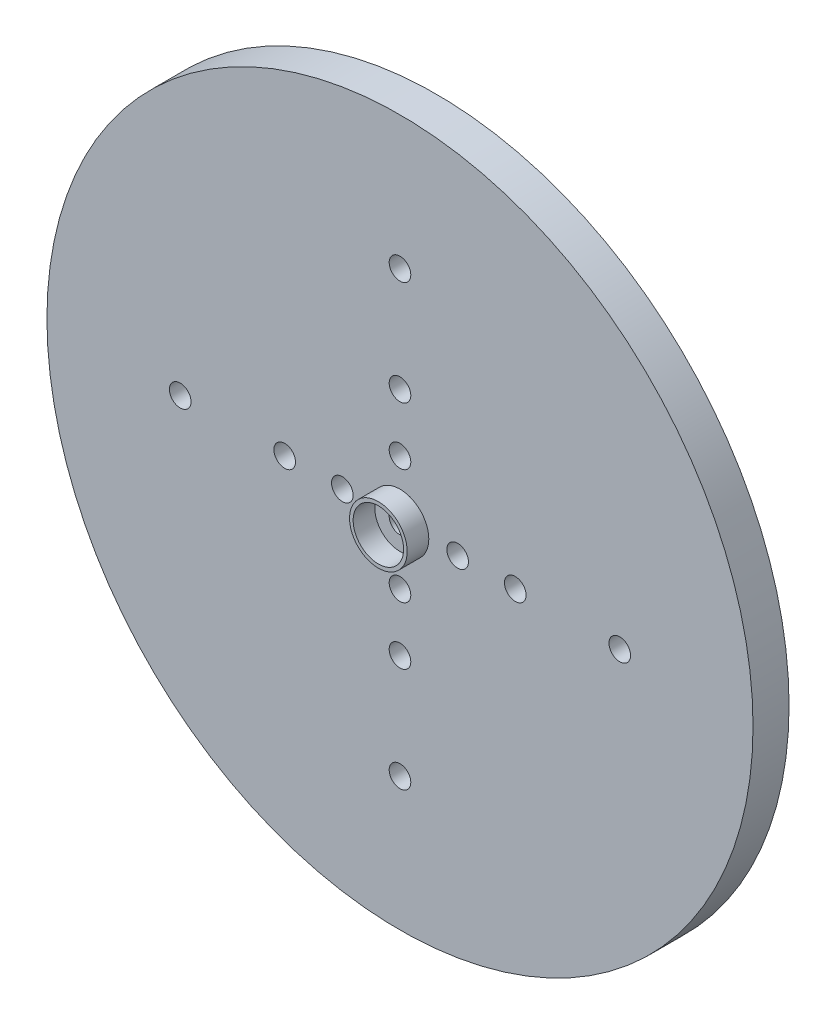
ISO-10303-21;
HEADER;
FILE_DESCRIPTION(('STEP AP214'),'2;1');
FILE_NAME('part.step','',(''),(''),'','','');
FILE_SCHEMA(('AUTOMOTIVE_DESIGN { 1 0 10303 214 1 1 1 1 }'));
ENDSEC;
DATA;
#1=APPLICATION_CONTEXT('core data for automotive mechanical design processes');
#2=APPLICATION_PROTOCOL_DEFINITION('international standard','automotive_design',2000,#1);
#3=PRODUCT_CONTEXT('',#1,'mechanical');
#4=PRODUCT('Part','Part','',(#3));
#5=PRODUCT_RELATED_PRODUCT_CATEGORY('part','',(#4));
#6=PRODUCT_DEFINITION_FORMATION('','',#4);
#7=PRODUCT_DEFINITION_CONTEXT('part definition',#1,'design');
#8=PRODUCT_DEFINITION('design','',#6,#7);
#9=PRODUCT_DEFINITION_SHAPE('','',#8);
#10=(LENGTH_UNIT() NAMED_UNIT(*) SI_UNIT(.MILLI.,.METRE.));
#11=(NAMED_UNIT(*) PLANE_ANGLE_UNIT() SI_UNIT($,.RADIAN.));
#12=(NAMED_UNIT(*) SI_UNIT($,.STERADIAN.) SOLID_ANGLE_UNIT());
#13=UNCERTAINTY_MEASURE_WITH_UNIT(LENGTH_MEASURE(1.E-05),#10,'distance_accuracy_value','');
#14=(GEOMETRIC_REPRESENTATION_CONTEXT(3) GLOBAL_UNCERTAINTY_ASSIGNED_CONTEXT((#13)) GLOBAL_UNIT_ASSIGNED_CONTEXT((#10,
#11,#12)) REPRESENTATION_CONTEXT('',''));
#15=CARTESIAN_POINT('',(0.,0.,0.));
#16=DIRECTION('',(0.,0.,1.));
#17=DIRECTION('',(1.,0.,0.));
#18=AXIS2_PLACEMENT_3D('',#15,#16,#17);
#19=CARTESIAN_POINT('',(-26.6505829621075,0.,5.));
#20=DIRECTION('',(0.,0.,-1.));
#21=DIRECTION('',(-1.,0.,0.));
#22=AXIS2_PLACEMENT_3D('',#19,#20,#21);
#23=CYLINDRICAL_SURFACE('',#22,49.);
#24=CARTESIAN_POINT('',(-26.6505829621075,0.,5.));
#25=DIRECTION('',(0.,0.,1.));
#26=DIRECTION('',(1.,0.,0.));
#27=AXIS2_PLACEMENT_3D('',#24,#25,#26);
#28=CIRCLE('',#27,49.);
#29=CARTESIAN_POINT('',(22.3494170378925,0.,5.));
#30=VERTEX_POINT('',#29);
#31=EDGE_CURVE('E40',#30,#30,#28,.T.);
#32=ORIENTED_EDGE('',*,*,#31,.F.);
#33=EDGE_LOOP('',(#32));
#34=FACE_BOUND('',#33,.T.);
#35=CARTESIAN_POINT('',(-26.6505829621075,0.,0.));
#36=DIRECTION('',(0.,0.,1.));
#37=DIRECTION('',(1.,0.,0.));
#38=AXIS2_PLACEMENT_3D('',#35,#36,#37);
#39=CIRCLE('',#38,49.);
#40=CARTESIAN_POINT('',(22.3494170378925,0.,0.));
#41=VERTEX_POINT('',#40);
#42=EDGE_CURVE('E44',#41,#41,#39,.T.);
#43=ORIENTED_EDGE('',*,*,#42,.T.);
#44=EDGE_LOOP('',(#43));
#45=FACE_BOUND('',#44,.T.);
#46=ADVANCED_FACE('F30',(#34,#45),#23,.T.);
#47=CARTESIAN_POINT('',(-26.6505829621075,0.,5.));
#48=DIRECTION('',(0.,0.,1.));
#49=DIRECTION('',(1.,0.,0.));
#50=AXIS2_PLACEMENT_3D('',#47,#48,#49);
#51=PLANE('',#50);
#52=CARTESIAN_POINT('',(-26.6505829621078,-30.5,5.));
#53=DIRECTION('',(0.,0.,1.));
#54=DIRECTION('',(1.,0.,0.));
#55=AXIS2_PLACEMENT_3D('',#52,#53,#54);
#56=CIRCLE('',#55,1.5);
#57=CARTESIAN_POINT('',(-25.1505829621078,-30.5,5.));
#58=VERTEX_POINT('',#57);
#59=EDGE_CURVE('E140',#58,#58,#56,.T.);
#60=ORIENTED_EDGE('',*,*,#59,.F.);
#61=EDGE_LOOP('',(#60));
#62=FACE_BOUND('',#61,.T.);
#63=CARTESIAN_POINT('',(-26.6505829621076,-16.,5.));
#64=DIRECTION('',(0.,0.,1.));
#65=DIRECTION('',(1.,0.,0.));
#66=AXIS2_PLACEMENT_3D('',#63,#64,#65);
#67=CIRCLE('',#66,1.5);
#68=CARTESIAN_POINT('',(-25.1505829621076,-16.,5.));
#69=VERTEX_POINT('',#68);
#70=EDGE_CURVE('E134',#69,#69,#67,.T.);
#71=ORIENTED_EDGE('',*,*,#70,.F.);
#72=EDGE_LOOP('',(#71));
#73=FACE_BOUND('',#72,.T.);
#74=CARTESIAN_POINT('',(-26.6505829621075,-8.,5.));
#75=DIRECTION('',(0.,0.,1.));
#76=DIRECTION('',(1.,0.,0.));
#77=AXIS2_PLACEMENT_3D('',#74,#75,#76);
#78=CIRCLE('',#77,1.5);
#79=CARTESIAN_POINT('',(-25.1505829621075,-8.,5.));
#80=VERTEX_POINT('',#79);
#81=EDGE_CURVE('E128',#80,#80,#78,.T.);
#82=ORIENTED_EDGE('',*,*,#81,.F.);
#83=EDGE_LOOP('',(#82));
#84=FACE_BOUND('',#83,.T.);
#85=CARTESIAN_POINT('',(3.84941703789254,-2.09245188932032E-13,5.));
#86=DIRECTION('',(0.,0.,1.));
#87=DIRECTION('',(1.,0.,0.));
#88=AXIS2_PLACEMENT_3D('',#85,#86,#87);
#89=CIRCLE('',#88,1.49999999999999);
#90=CARTESIAN_POINT('',(5.34941703789254,-2.09245188932032E-13,5.));
#91=VERTEX_POINT('',#90);
#92=EDGE_CURVE('E122',#91,#91,#89,.T.);
#93=ORIENTED_EDGE('',*,*,#92,.F.);
#94=EDGE_LOOP('',(#93));
#95=FACE_BOUND('',#94,.T.);
#96=CARTESIAN_POINT('',(-10.6505829621075,-1.09767967964345E-13,5.));
#97=DIRECTION('',(0.,0.,1.));
#98=DIRECTION('',(1.,0.,0.));
#99=AXIS2_PLACEMENT_3D('',#96,#97,#98);
#100=CIRCLE('',#99,1.49999999999999);
#101=CARTESIAN_POINT('',(-9.15058296210746,-1.09767967964345E-13,5.));
#102=VERTEX_POINT('',#101);
#103=EDGE_CURVE('E116',#102,#102,#100,.T.);
#104=ORIENTED_EDGE('',*,*,#103,.F.);
#105=EDGE_LOOP('',(#104));
#106=FACE_BOUND('',#105,.T.);
#107=CARTESIAN_POINT('',(-18.6505829621075,0.,5.));
#108=DIRECTION('',(0.,0.,1.));
#109=DIRECTION('',(1.,0.,0.));
#110=AXIS2_PLACEMENT_3D('',#107,#108,#109);
#111=CIRCLE('',#110,1.49999999999999);
#112=CARTESIAN_POINT('',(-17.1505829621075,0.,5.));
#113=VERTEX_POINT('',#112);
#114=EDGE_CURVE('E110',#113,#113,#111,.T.);
#115=ORIENTED_EDGE('',*,*,#114,.F.);
#116=EDGE_LOOP('',(#115));
#117=FACE_BOUND('',#116,.T.);
#118=CARTESIAN_POINT('',(-26.6505829621074,30.5,5.));
#119=DIRECTION('',(0.,0.,1.));
#120=DIRECTION('',(1.,0.,0.));
#121=AXIS2_PLACEMENT_3D('',#118,#119,#120);
#122=CIRCLE('',#121,1.5);
#123=CARTESIAN_POINT('',(-25.1505829621074,30.5,5.));
#124=VERTEX_POINT('',#123);
#125=EDGE_CURVE('E104',#124,#124,#122,.T.);
#126=ORIENTED_EDGE('',*,*,#125,.F.);
#127=EDGE_LOOP('',(#126));
#128=FACE_BOUND('',#127,.T.);
#129=CARTESIAN_POINT('',(-26.6505829621074,16.,5.));
#130=DIRECTION('',(0.,0.,1.));
#131=DIRECTION('',(1.,0.,0.));
#132=AXIS2_PLACEMENT_3D('',#129,#130,#131);
#133=CIRCLE('',#132,1.5);
#134=CARTESIAN_POINT('',(-25.1505829621074,16.,5.));
#135=VERTEX_POINT('',#134);
#136=EDGE_CURVE('E98',#135,#135,#133,.T.);
#137=ORIENTED_EDGE('',*,*,#136,.F.);
#138=EDGE_LOOP('',(#137));
#139=FACE_BOUND('',#138,.T.);
#140=CARTESIAN_POINT('',(-26.6505829621074,8.,5.));
#141=DIRECTION('',(0.,0.,1.));
#142=DIRECTION('',(1.,0.,0.));
#143=AXIS2_PLACEMENT_3D('',#140,#141,#142);
#144=CIRCLE('',#143,1.49999999999999);
#145=CARTESIAN_POINT('',(-25.1505829621074,8.,5.));
#146=VERTEX_POINT('',#145);
#147=EDGE_CURVE('E92',#146,#146,#144,.T.);
#148=ORIENTED_EDGE('',*,*,#147,.F.);
#149=EDGE_LOOP('',(#148));
#150=FACE_BOUND('',#149,.T.);
#151=CARTESIAN_POINT('',(-57.1505829621075,0.,5.));
#152=DIRECTION('',(0.,0.,1.));
#153=DIRECTION('',(1.,0.,0.));
#154=AXIS2_PLACEMENT_3D('',#151,#152,#153);
#155=CIRCLE('',#154,1.5);
#156=CARTESIAN_POINT('',(-55.6505829621075,0.,5.));
#157=VERTEX_POINT('',#156);
#158=EDGE_CURVE('E86',#157,#157,#155,.T.);
#159=ORIENTED_EDGE('',*,*,#158,.F.);
#160=EDGE_LOOP('',(#159));
#161=FACE_BOUND('',#160,.T.);
#162=CARTESIAN_POINT('',(-42.6505829621075,0.,5.));
#163=DIRECTION('',(0.,0.,1.));
#164=DIRECTION('',(1.,0.,0.));
#165=AXIS2_PLACEMENT_3D('',#162,#163,#164);
#166=CIRCLE('',#165,1.5);
#167=CARTESIAN_POINT('',(-41.1505829621075,0.,5.));
#168=VERTEX_POINT('',#167);
#169=EDGE_CURVE('E80',#168,#168,#166,.T.);
#170=ORIENTED_EDGE('',*,*,#169,.F.);
#171=EDGE_LOOP('',(#170));
#172=FACE_BOUND('',#171,.T.);
#173=CARTESIAN_POINT('',(-34.6505829621075,0.,5.));
#174=DIRECTION('',(0.,0.,1.));
#175=DIRECTION('',(1.,0.,0.));
#176=AXIS2_PLACEMENT_3D('',#173,#174,#175);
#177=CIRCLE('',#176,1.5);
#178=CARTESIAN_POINT('',(-33.1505829621075,0.,5.));
#179=VERTEX_POINT('',#178);
#180=EDGE_CURVE('E74',#179,#179,#177,.T.);
#181=ORIENTED_EDGE('',*,*,#180,.F.);
#182=EDGE_LOOP('',(#181));
#183=FACE_BOUND('',#182,.T.);
#184=CARTESIAN_POINT('',(-26.6505829621075,0.,5.));
#185=DIRECTION('',(0.,0.,1.));
#186=DIRECTION('',(1.,0.,0.));
#187=AXIS2_PLACEMENT_3D('',#184,#185,#186);
#188=CIRCLE('',#187,4.);
#189=CARTESIAN_POINT('',(-22.6505829621075,0.,5.));
#190=VERTEX_POINT('',#189);
#191=EDGE_CURVE('E59',#190,#190,#188,.T.);
#192=ORIENTED_EDGE('',*,*,#191,.F.);
#193=EDGE_LOOP('',(#192));
#194=FACE_BOUND('',#193,.T.);
#195=ORIENTED_EDGE('',*,*,#31,.T.);
#196=EDGE_LOOP('',(#195));
#197=FACE_BOUND('',#196,.T.);
#198=ADVANCED_FACE('F156',(#62,#73,#84,#95,#106,#117,#128,#139,#150,#161,#172,#183,#194,#197),
#51,.T.);
#199=CARTESIAN_POINT('',(-26.6505829621075,0.,0.));
#200=DIRECTION('',(0.,0.,1.));
#201=DIRECTION('',(1.,0.,0.));
#202=AXIS2_PLACEMENT_3D('',#199,#200,#201);
#203=PLANE('',#202);
#204=CARTESIAN_POINT('',(-26.6505829621078,-30.5,0.));
#205=DIRECTION('',(0.,0.,1.));
#206=DIRECTION('',(1.,0.,0.));
#207=AXIS2_PLACEMENT_3D('',#204,#205,#206);
#208=CIRCLE('',#207,1.5);
#209=CARTESIAN_POINT('',(-25.1505829621078,-30.5,0.));
#210=VERTEX_POINT('',#209);
#211=EDGE_CURVE('E137',#210,#210,#208,.T.);
#212=ORIENTED_EDGE('',*,*,#211,.T.);
#213=EDGE_LOOP('',(#212));
#214=FACE_BOUND('',#213,.T.);
#215=CARTESIAN_POINT('',(-26.6505829621076,-16.,0.));
#216=DIRECTION('',(0.,0.,1.));
#217=DIRECTION('',(1.,0.,0.));
#218=AXIS2_PLACEMENT_3D('',#215,#216,#217);
#219=CIRCLE('',#218,1.5);
#220=CARTESIAN_POINT('',(-25.1505829621076,-16.,0.));
#221=VERTEX_POINT('',#220);
#222=EDGE_CURVE('E131',#221,#221,#219,.T.);
#223=ORIENTED_EDGE('',*,*,#222,.T.);
#224=EDGE_LOOP('',(#223));
#225=FACE_BOUND('',#224,.T.);
#226=CARTESIAN_POINT('',(-26.6505829621075,-8.,0.));
#227=DIRECTION('',(0.,0.,1.));
#228=DIRECTION('',(1.,0.,0.));
#229=AXIS2_PLACEMENT_3D('',#226,#227,#228);
#230=CIRCLE('',#229,1.5);
#231=CARTESIAN_POINT('',(-25.1505829621075,-8.,0.));
#232=VERTEX_POINT('',#231);
#233=EDGE_CURVE('E125',#232,#232,#230,.T.);
#234=ORIENTED_EDGE('',*,*,#233,.T.);
#235=EDGE_LOOP('',(#234));
#236=FACE_BOUND('',#235,.T.);
#237=CARTESIAN_POINT('',(3.84941703789254,-2.09245188932032E-13,0.));
#238=DIRECTION('',(0.,0.,1.));
#239=DIRECTION('',(1.,0.,0.));
#240=AXIS2_PLACEMENT_3D('',#237,#238,#239);
#241=CIRCLE('',#240,1.49999999999999);
#242=CARTESIAN_POINT('',(5.34941703789254,-2.09245188932032E-13,0.));
#243=VERTEX_POINT('',#242);
#244=EDGE_CURVE('E119',#243,#243,#241,.T.);
#245=ORIENTED_EDGE('',*,*,#244,.T.);
#246=EDGE_LOOP('',(#245));
#247=FACE_BOUND('',#246,.T.);
#248=CARTESIAN_POINT('',(-10.6505829621075,-1.09767967964345E-13,0.));
#249=DIRECTION('',(0.,0.,1.));
#250=DIRECTION('',(1.,0.,0.));
#251=AXIS2_PLACEMENT_3D('',#248,#249,#250);
#252=CIRCLE('',#251,1.49999999999999);
#253=CARTESIAN_POINT('',(-9.15058296210746,-1.09767967964345E-13,0.));
#254=VERTEX_POINT('',#253);
#255=EDGE_CURVE('E113',#254,#254,#252,.T.);
#256=ORIENTED_EDGE('',*,*,#255,.T.);
#257=EDGE_LOOP('',(#256));
#258=FACE_BOUND('',#257,.T.);
#259=CARTESIAN_POINT('',(-18.6505829621075,0.,0.));
#260=DIRECTION('',(0.,0.,1.));
#261=DIRECTION('',(1.,0.,0.));
#262=AXIS2_PLACEMENT_3D('',#259,#260,#261);
#263=CIRCLE('',#262,1.49999999999999);
#264=CARTESIAN_POINT('',(-17.1505829621075,0.,0.));
#265=VERTEX_POINT('',#264);
#266=EDGE_CURVE('E107',#265,#265,#263,.T.);
#267=ORIENTED_EDGE('',*,*,#266,.T.);
#268=EDGE_LOOP('',(#267));
#269=FACE_BOUND('',#268,.T.);
#270=CARTESIAN_POINT('',(-26.6505829621074,30.5,0.));
#271=DIRECTION('',(0.,0.,1.));
#272=DIRECTION('',(1.,0.,0.));
#273=AXIS2_PLACEMENT_3D('',#270,#271,#272);
#274=CIRCLE('',#273,1.5);
#275=CARTESIAN_POINT('',(-25.1505829621074,30.5,0.));
#276=VERTEX_POINT('',#275);
#277=EDGE_CURVE('E101',#276,#276,#274,.T.);
#278=ORIENTED_EDGE('',*,*,#277,.T.);
#279=EDGE_LOOP('',(#278));
#280=FACE_BOUND('',#279,.T.);
#281=CARTESIAN_POINT('',(-26.6505829621074,16.,0.));
#282=DIRECTION('',(0.,0.,1.));
#283=DIRECTION('',(1.,0.,0.));
#284=AXIS2_PLACEMENT_3D('',#281,#282,#283);
#285=CIRCLE('',#284,1.5);
#286=CARTESIAN_POINT('',(-25.1505829621074,16.,0.));
#287=VERTEX_POINT('',#286);
#288=EDGE_CURVE('E95',#287,#287,#285,.T.);
#289=ORIENTED_EDGE('',*,*,#288,.T.);
#290=EDGE_LOOP('',(#289));
#291=FACE_BOUND('',#290,.T.);
#292=CARTESIAN_POINT('',(-26.6505829621074,8.,0.));
#293=DIRECTION('',(0.,0.,1.));
#294=DIRECTION('',(1.,0.,0.));
#295=AXIS2_PLACEMENT_3D('',#292,#293,#294);
#296=CIRCLE('',#295,1.49999999999999);
#297=CARTESIAN_POINT('',(-25.1505829621074,8.,0.));
#298=VERTEX_POINT('',#297);
#299=EDGE_CURVE('E89',#298,#298,#296,.T.);
#300=ORIENTED_EDGE('',*,*,#299,.T.);
#301=EDGE_LOOP('',(#300));
#302=FACE_BOUND('',#301,.T.);
#303=CARTESIAN_POINT('',(-57.1505829621075,0.,0.));
#304=DIRECTION('',(0.,0.,1.));
#305=DIRECTION('',(1.,0.,0.));
#306=AXIS2_PLACEMENT_3D('',#303,#304,#305);
#307=CIRCLE('',#306,1.5);
#308=CARTESIAN_POINT('',(-55.6505829621075,0.,0.));
#309=VERTEX_POINT('',#308);
#310=EDGE_CURVE('E83',#309,#309,#307,.T.);
#311=ORIENTED_EDGE('',*,*,#310,.T.);
#312=EDGE_LOOP('',(#311));
#313=FACE_BOUND('',#312,.T.);
#314=CARTESIAN_POINT('',(-42.6505829621075,0.,0.));
#315=DIRECTION('',(0.,0.,1.));
#316=DIRECTION('',(1.,0.,0.));
#317=AXIS2_PLACEMENT_3D('',#314,#315,#316);
#318=CIRCLE('',#317,1.5);
#319=CARTESIAN_POINT('',(-41.1505829621075,0.,0.));
#320=VERTEX_POINT('',#319);
#321=EDGE_CURVE('E77',#320,#320,#318,.T.);
#322=ORIENTED_EDGE('',*,*,#321,.T.);
#323=EDGE_LOOP('',(#322));
#324=FACE_BOUND('',#323,.T.);
#325=CARTESIAN_POINT('',(-34.6505829621075,0.,0.));
#326=DIRECTION('',(0.,0.,1.));
#327=DIRECTION('',(1.,0.,0.));
#328=AXIS2_PLACEMENT_3D('',#325,#326,#327);
#329=CIRCLE('',#328,1.5);
#330=CARTESIAN_POINT('',(-33.1505829621075,0.,0.));
#331=VERTEX_POINT('',#330);
#332=EDGE_CURVE('E71',#331,#331,#329,.T.);
#333=ORIENTED_EDGE('',*,*,#332,.T.);
#334=EDGE_LOOP('',(#333));
#335=FACE_BOUND('',#334,.T.);
#336=CARTESIAN_POINT('',(-26.6505829621075,0.,0.));
#337=DIRECTION('',(0.,0.,1.));
#338=DIRECTION('',(1.,0.,0.));
#339=AXIS2_PLACEMENT_3D('',#336,#337,#338);
#340=CIRCLE('',#339,4.5);
#341=CARTESIAN_POINT('',(-22.1505829621075,0.,0.));
#342=VERTEX_POINT('',#341);
#343=EDGE_CURVE('E36',#342,#342,#340,.F.);
#344=ORIENTED_EDGE('',*,*,#343,.F.);
#345=EDGE_LOOP('',(#344));
#346=FACE_BOUND('',#345,.T.);
#347=ORIENTED_EDGE('',*,*,#42,.F.);
#348=EDGE_LOOP('',(#347));
#349=FACE_BOUND('',#348,.T.);
#350=ADVANCED_FACE('F146',(#214,#225,#236,#247,#258,#269,#280,#291,#302,#313,#324,#335,#346,
#349),#203,.F.);
#351=CARTESIAN_POINT('',(-26.6505829621075,0.,-4.));
#352=DIRECTION('',(0.,0.,-1.));
#353=DIRECTION('',(-1.,0.,0.));
#354=AXIS2_PLACEMENT_3D('',#351,#352,#353);
#355=PLANE('',#354);
#356=CARTESIAN_POINT('',(-26.6505829621075,0.,-4.));
#357=DIRECTION('',(0.,0.,-1.));
#358=DIRECTION('',(-1.,0.,0.));
#359=AXIS2_PLACEMENT_3D('',#356,#357,#358);
#360=CIRCLE('',#359,4.5);
#361=CARTESIAN_POINT('',(-31.1505829621075,0.,-4.));
#362=VERTEX_POINT('',#361);
#363=EDGE_CURVE('E48',#362,#362,#360,.T.);
#364=ORIENTED_EDGE('',*,*,#363,.T.);
#365=EDGE_LOOP('',(#364));
#366=FACE_BOUND('',#365,.T.);
#367=CARTESIAN_POINT('',(-26.6505829621075,0.,-4.));
#368=DIRECTION('',(0.,0.,-1.));
#369=DIRECTION('',(-1.,0.,0.));
#370=AXIS2_PLACEMENT_3D('',#367,#368,#369);
#371=CIRCLE('',#370,3.);
#372=CARTESIAN_POINT('',(-29.6505829621075,0.,-4.));
#373=VERTEX_POINT('',#372);
#374=EDGE_CURVE('E52',#373,#373,#371,.T.);
#375=ORIENTED_EDGE('',*,*,#374,.F.);
#376=EDGE_LOOP('',(#375));
#377=FACE_BOUND('',#376,.T.);
#378=ADVANCED_FACE('F192',(#366,#377),#355,.T.);
#379=CARTESIAN_POINT('',(-26.6505829621075,0.,-4.));
#380=DIRECTION('',(0.,0.,1.));
#381=DIRECTION('',(1.,0.,0.));
#382=AXIS2_PLACEMENT_3D('',#379,#380,#381);
#383=CYLINDRICAL_SURFACE('',#382,4.5);
#384=ORIENTED_EDGE('',*,*,#363,.F.);
#385=EDGE_LOOP('',(#384));
#386=FACE_BOUND('',#385,.T.);
#387=ORIENTED_EDGE('',*,*,#343,.T.);
#388=EDGE_LOOP('',(#387));
#389=FACE_BOUND('',#388,.T.);
#390=ADVANCED_FACE('F197',(#386,#389),#383,.T.);
#391=CARTESIAN_POINT('',(-26.6505829621075,0.,-4.));
#392=DIRECTION('',(0.,0.,1.));
#393=DIRECTION('',(1.,0.,0.));
#394=AXIS2_PLACEMENT_3D('',#391,#392,#393);
#395=CYLINDRICAL_SURFACE('',#394,3.);
#396=ORIENTED_EDGE('',*,*,#374,.T.);
#397=EDGE_LOOP('',(#396));
#398=FACE_BOUND('',#397,.T.);
#399=CARTESIAN_POINT('',(-26.6505829621075,0.,0.));
#400=DIRECTION('',(0.,0.,-1.));
#401=DIRECTION('',(-1.,0.,0.));
#402=AXIS2_PLACEMENT_3D('',#399,#400,#401);
#403=CIRCLE('',#402,3.);
#404=CARTESIAN_POINT('',(-29.6505829621075,0.,0.));
#405=VERTEX_POINT('',#404);
#406=EDGE_CURVE('E53',#405,#405,#403,.T.);
#407=ORIENTED_EDGE('',*,*,#406,.F.);
#408=EDGE_LOOP('',(#407));
#409=FACE_BOUND('',#408,.T.);
#410=ADVANCED_FACE('F202',(#398,#409),#395,.F.);
#411=CARTESIAN_POINT('',(-26.6505829621075,0.,0.));
#412=DIRECTION('',(0.,0.,1.));
#413=DIRECTION('',(1.,0.,0.));
#414=AXIS2_PLACEMENT_3D('',#411,#412,#413);
#415=CIRCLE('',#414,1.5);
#416=CARTESIAN_POINT('',(-25.1505829621075,0.,0.));
#417=VERTEX_POINT('',#416);
#418=EDGE_CURVE('E67',#417,#417,#415,.T.);
#419=ORIENTED_EDGE('',*,*,#418,.T.);
#420=EDGE_LOOP('',(#419));
#421=FACE_BOUND('',#420,.T.);
#422=ORIENTED_EDGE('',*,*,#406,.T.);
#423=EDGE_LOOP('',(#422));
#424=FACE_BOUND('',#423,.T.);
#425=ADVANCED_FACE('F193',(#421,#424),#203,.F.);
#426=CARTESIAN_POINT('',(-26.6505829621075,0.,8.));
#427=DIRECTION('',(0.,0.,1.));
#428=DIRECTION('',(1.,0.,0.));
#429=AXIS2_PLACEMENT_3D('',#426,#427,#428);
#430=PLANE('',#429);
#431=CARTESIAN_POINT('',(-26.6505829621075,0.,8.));
#432=DIRECTION('',(0.,0.,1.));
#433=DIRECTION('',(1.,0.,0.));
#434=AXIS2_PLACEMENT_3D('',#431,#432,#433);
#435=CIRCLE('',#434,4.);
#436=CARTESIAN_POINT('',(-22.6505829621075,0.,8.));
#437=VERTEX_POINT('',#436);
#438=EDGE_CURVE('E56',#437,#437,#435,.T.);
#439=ORIENTED_EDGE('',*,*,#438,.T.);
#440=EDGE_LOOP('',(#439));
#441=FACE_BOUND('',#440,.T.);
#442=CARTESIAN_POINT('',(-26.6505829621075,0.,8.));
#443=DIRECTION('',(0.,0.,1.));
#444=DIRECTION('',(1.,0.,0.));
#445=AXIS2_PLACEMENT_3D('',#442,#443,#444);
#446=CIRCLE('',#445,3.5);
#447=CARTESIAN_POINT('',(-23.1505829621075,0.,8.));
#448=VERTEX_POINT('',#447);
#449=EDGE_CURVE('E62',#448,#448,#446,.T.);
#450=ORIENTED_EDGE('',*,*,#449,.F.);
#451=EDGE_LOOP('',(#450));
#452=FACE_BOUND('',#451,.T.);
#453=ADVANCED_FACE('F201',(#441,#452),#430,.T.);
#454=CARTESIAN_POINT('',(-26.6505829621075,0.,8.));
#455=DIRECTION('',(0.,0.,-1.));
#456=DIRECTION('',(-1.,0.,0.));
#457=AXIS2_PLACEMENT_3D('',#454,#455,#456);
#458=CYLINDRICAL_SURFACE('',#457,4.);
#459=ORIENTED_EDGE('',*,*,#438,.F.);
#460=EDGE_LOOP('',(#459));
#461=FACE_BOUND('',#460,.T.);
#462=ORIENTED_EDGE('',*,*,#191,.T.);
#463=EDGE_LOOP('',(#462));
#464=FACE_BOUND('',#463,.T.);
#465=ADVANCED_FACE('F208',(#461,#464),#458,.T.);
#466=CARTESIAN_POINT('',(-26.6505829621075,0.,8.));
#467=DIRECTION('',(0.,0.,-1.));
#468=DIRECTION('',(-1.,0.,0.));
#469=AXIS2_PLACEMENT_3D('',#466,#467,#468);
#470=CYLINDRICAL_SURFACE('',#469,3.5);
#471=ORIENTED_EDGE('',*,*,#449,.T.);
#472=EDGE_LOOP('',(#471));
#473=FACE_BOUND('',#472,.T.);
#474=CARTESIAN_POINT('',(-26.6505829621075,0.,5.));
#475=DIRECTION('',(0.,0.,1.));
#476=DIRECTION('',(1.,0.,0.));
#477=AXIS2_PLACEMENT_3D('',#474,#475,#476);
#478=CIRCLE('',#477,3.5);
#479=CARTESIAN_POINT('',(-23.1505829621075,0.,5.));
#480=VERTEX_POINT('',#479);
#481=EDGE_CURVE('E10',#480,#480,#478,.F.);
#482=ORIENTED_EDGE('',*,*,#481,.T.);
#483=EDGE_LOOP('',(#482));
#484=FACE_BOUND('',#483,.T.);
#485=ADVANCED_FACE('F227',(#473,#484),#470,.F.);
#486=CARTESIAN_POINT('',(-26.6505829621075,0.,5.));
#487=DIRECTION('',(0.,0.,1.));
#488=DIRECTION('',(1.,0.,0.));
#489=AXIS2_PLACEMENT_3D('',#486,#487,#488);
#490=CIRCLE('',#489,1.5);
#491=CARTESIAN_POINT('',(-25.1505829621075,0.,5.));
#492=VERTEX_POINT('',#491);
#493=EDGE_CURVE('E68',#492,#492,#490,.T.);
#494=ORIENTED_EDGE('',*,*,#493,.F.);
#495=EDGE_LOOP('',(#494));
#496=FACE_BOUND('',#495,.T.);
#497=ORIENTED_EDGE('',*,*,#481,.F.);
#498=EDGE_LOOP('',(#497));
#499=FACE_BOUND('',#498,.T.);
#500=ADVANCED_FACE('F160',(#496,#499),#51,.T.);
#501=CARTESIAN_POINT('',(-26.6505829621075,0.,0.));
#502=DIRECTION('',(0.,0.,1.));
#503=DIRECTION('',(1.,0.,0.));
#504=AXIS2_PLACEMENT_3D('',#501,#502,#503);
#505=CYLINDRICAL_SURFACE('',#504,1.5);
#506=ORIENTED_EDGE('',*,*,#418,.F.);
#507=EDGE_LOOP('',(#506));
#508=FACE_BOUND('',#507,.T.);
#509=ORIENTED_EDGE('',*,*,#493,.T.);
#510=EDGE_LOOP('',(#509));
#511=FACE_BOUND('',#510,.T.);
#512=ADVANCED_FACE('F218',(#508,#511),#505,.F.);
#513=CARTESIAN_POINT('',(-34.6505829621075,0.,0.));
#514=DIRECTION('',(0.,0.,1.));
#515=DIRECTION('',(1.,0.,0.));
#516=AXIS2_PLACEMENT_3D('',#513,#514,#515);
#517=CYLINDRICAL_SURFACE('',#516,1.5);
#518=ORIENTED_EDGE('',*,*,#332,.F.);
#519=EDGE_LOOP('',(#518));
#520=FACE_BOUND('',#519,.T.);
#521=ORIENTED_EDGE('',*,*,#180,.T.);
#522=EDGE_LOOP('',(#521));
#523=FACE_BOUND('',#522,.T.);
#524=ADVANCED_FACE('F221',(#520,#523),#517,.F.);
#525=CARTESIAN_POINT('',(-42.6505829621075,0.,0.));
#526=DIRECTION('',(0.,0.,1.));
#527=DIRECTION('',(1.,0.,0.));
#528=AXIS2_PLACEMENT_3D('',#525,#526,#527);
#529=CYLINDRICAL_SURFACE('',#528,1.5);
#530=ORIENTED_EDGE('',*,*,#321,.F.);
#531=EDGE_LOOP('',(#530));
#532=FACE_BOUND('',#531,.T.);
#533=ORIENTED_EDGE('',*,*,#169,.T.);
#534=EDGE_LOOP('',(#533));
#535=FACE_BOUND('',#534,.T.);
#536=ADVANCED_FACE('F242',(#532,#535),#529,.F.);
#537=CARTESIAN_POINT('',(-57.1505829621075,0.,0.));
#538=DIRECTION('',(0.,0.,1.));
#539=DIRECTION('',(1.,0.,0.));
#540=AXIS2_PLACEMENT_3D('',#537,#538,#539);
#541=CYLINDRICAL_SURFACE('',#540,1.5);
#542=ORIENTED_EDGE('',*,*,#310,.F.);
#543=EDGE_LOOP('',(#542));
#544=FACE_BOUND('',#543,.T.);
#545=ORIENTED_EDGE('',*,*,#158,.T.);
#546=EDGE_LOOP('',(#545));
#547=FACE_BOUND('',#546,.T.);
#548=ADVANCED_FACE('F246',(#544,#547),#541,.F.);
#549=CARTESIAN_POINT('',(-26.6505829621074,8.,0.));
#550=DIRECTION('',(0.,0.,1.));
#551=DIRECTION('',(1.,0.,0.));
#552=AXIS2_PLACEMENT_3D('',#549,#550,#551);
#553=CYLINDRICAL_SURFACE('',#552,1.49999999999999);
#554=ORIENTED_EDGE('',*,*,#299,.F.);
#555=EDGE_LOOP('',(#554));
#556=FACE_BOUND('',#555,.T.);
#557=ORIENTED_EDGE('',*,*,#147,.T.);
#558=EDGE_LOOP('',(#557));
#559=FACE_BOUND('',#558,.T.);
#560=ADVANCED_FACE('F250',(#556,#559),#553,.F.);
#561=CARTESIAN_POINT('',(-26.6505829621074,16.,0.));
#562=DIRECTION('',(0.,0.,1.));
#563=DIRECTION('',(1.,0.,0.));
#564=AXIS2_PLACEMENT_3D('',#561,#562,#563);
#565=CYLINDRICAL_SURFACE('',#564,1.5);
#566=ORIENTED_EDGE('',*,*,#288,.F.);
#567=EDGE_LOOP('',(#566));
#568=FACE_BOUND('',#567,.T.);
#569=ORIENTED_EDGE('',*,*,#136,.T.);
#570=EDGE_LOOP('',(#569));
#571=FACE_BOUND('',#570,.T.);
#572=ADVANCED_FACE('F254',(#568,#571),#565,.F.);
#573=CARTESIAN_POINT('',(-26.6505829621074,30.5,0.));
#574=DIRECTION('',(0.,0.,1.));
#575=DIRECTION('',(1.,0.,0.));
#576=AXIS2_PLACEMENT_3D('',#573,#574,#575);
#577=CYLINDRICAL_SURFACE('',#576,1.5);
#578=ORIENTED_EDGE('',*,*,#277,.F.);
#579=EDGE_LOOP('',(#578));
#580=FACE_BOUND('',#579,.T.);
#581=ORIENTED_EDGE('',*,*,#125,.T.);
#582=EDGE_LOOP('',(#581));
#583=FACE_BOUND('',#582,.T.);
#584=ADVANCED_FACE('F258',(#580,#583),#577,.F.);
#585=CARTESIAN_POINT('',(-18.6505829621075,0.,0.));
#586=DIRECTION('',(0.,0.,1.));
#587=DIRECTION('',(1.,0.,0.));
#588=AXIS2_PLACEMENT_3D('',#585,#586,#587);
#589=CYLINDRICAL_SURFACE('',#588,1.49999999999999);
#590=ORIENTED_EDGE('',*,*,#266,.F.);
#591=EDGE_LOOP('',(#590));
#592=FACE_BOUND('',#591,.T.);
#593=ORIENTED_EDGE('',*,*,#114,.T.);
#594=EDGE_LOOP('',(#593));
#595=FACE_BOUND('',#594,.T.);
#596=ADVANCED_FACE('F262',(#592,#595),#589,.F.);
#597=CARTESIAN_POINT('',(-10.6505829621075,-1.09767967964345E-13,0.));
#598=DIRECTION('',(0.,0.,1.));
#599=DIRECTION('',(1.,0.,0.));
#600=AXIS2_PLACEMENT_3D('',#597,#598,#599);
#601=CYLINDRICAL_SURFACE('',#600,1.49999999999999);
#602=ORIENTED_EDGE('',*,*,#255,.F.);
#603=EDGE_LOOP('',(#602));
#604=FACE_BOUND('',#603,.T.);
#605=ORIENTED_EDGE('',*,*,#103,.T.);
#606=EDGE_LOOP('',(#605));
#607=FACE_BOUND('',#606,.T.);
#608=ADVANCED_FACE('F266',(#604,#607),#601,.F.);
#609=CARTESIAN_POINT('',(3.84941703789254,-2.09245188932032E-13,0.));
#610=DIRECTION('',(0.,0.,1.));
#611=DIRECTION('',(1.,0.,0.));
#612=AXIS2_PLACEMENT_3D('',#609,#610,#611);
#613=CYLINDRICAL_SURFACE('',#612,1.49999999999999);
#614=ORIENTED_EDGE('',*,*,#244,.F.);
#615=EDGE_LOOP('',(#614));
#616=FACE_BOUND('',#615,.T.);
#617=ORIENTED_EDGE('',*,*,#92,.T.);
#618=EDGE_LOOP('',(#617));
#619=FACE_BOUND('',#618,.T.);
#620=ADVANCED_FACE('F270',(#616,#619),#613,.F.);
#621=CARTESIAN_POINT('',(-26.6505829621075,-8.,0.));
#622=DIRECTION('',(0.,0.,1.));
#623=DIRECTION('',(1.,0.,0.));
#624=AXIS2_PLACEMENT_3D('',#621,#622,#623);
#625=CYLINDRICAL_SURFACE('',#624,1.5);
#626=ORIENTED_EDGE('',*,*,#233,.F.);
#627=EDGE_LOOP('',(#626));
#628=FACE_BOUND('',#627,.T.);
#629=ORIENTED_EDGE('',*,*,#81,.T.);
#630=EDGE_LOOP('',(#629));
#631=FACE_BOUND('',#630,.T.);
#632=ADVANCED_FACE('F274',(#628,#631),#625,.F.);
#633=CARTESIAN_POINT('',(-26.6505829621076,-16.,0.));
#634=DIRECTION('',(0.,0.,1.));
#635=DIRECTION('',(1.,0.,0.));
#636=AXIS2_PLACEMENT_3D('',#633,#634,#635);
#637=CYLINDRICAL_SURFACE('',#636,1.5);
#638=ORIENTED_EDGE('',*,*,#222,.F.);
#639=EDGE_LOOP('',(#638));
#640=FACE_BOUND('',#639,.T.);
#641=ORIENTED_EDGE('',*,*,#70,.T.);
#642=EDGE_LOOP('',(#641));
#643=FACE_BOUND('',#642,.T.);
#644=ADVANCED_FACE('F152',(#640,#643),#637,.F.);
#645=CARTESIAN_POINT('',(-26.6505829621078,-30.5,0.));
#646=DIRECTION('',(0.,0.,1.));
#647=DIRECTION('',(1.,0.,0.));
#648=AXIS2_PLACEMENT_3D('',#645,#646,#647);
#649=CYLINDRICAL_SURFACE('',#648,1.5);
#650=ORIENTED_EDGE('',*,*,#211,.F.);
#651=EDGE_LOOP('',(#650));
#652=FACE_BOUND('',#651,.T.);
#653=ORIENTED_EDGE('',*,*,#59,.T.);
#654=EDGE_LOOP('',(#653));
#655=FACE_BOUND('',#654,.T.);
#656=ADVANCED_FACE('F149',(#652,#655),#649,.F.);
#657=CLOSED_SHELL('',(#46,#198,#350,#378,#390,#410,#425,#453,#465,#485,#500,#512,#524,#536,#548,
#560,#572,#584,#596,#608,#620,#632,#644,#656));
#658=MANIFOLD_SOLID_BREP('B2',#657);
#659=ADVANCED_BREP_SHAPE_REPRESENTATION('',(#18,#658),#14);
#660=SHAPE_DEFINITION_REPRESENTATION(#9,#659);
ENDSEC;
END-ISO-10303-21;
